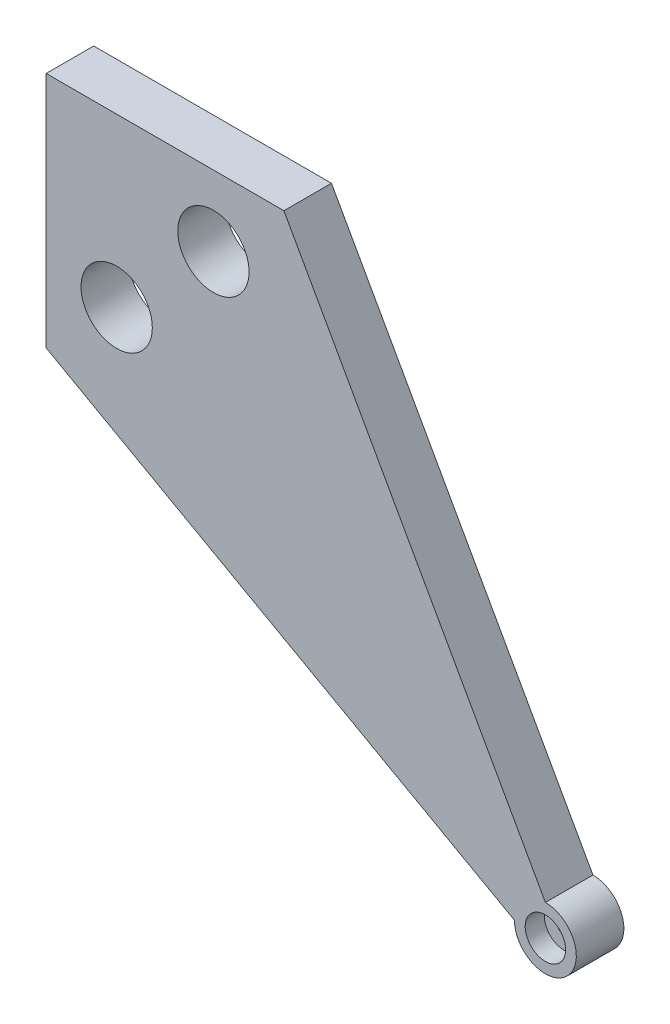
ISO-10303-21;
HEADER;
FILE_DESCRIPTION(('STEP AP214'),'2;1');
FILE_NAME('part.step','',(''),(''),'','','');
FILE_SCHEMA(('AUTOMOTIVE_DESIGN { 1 0 10303 214 1 1 1 1 }'));
ENDSEC;
DATA;
#1=APPLICATION_CONTEXT('core data for automotive mechanical design processes');
#2=APPLICATION_PROTOCOL_DEFINITION('international standard','automotive_design',2000,#1);
#3=PRODUCT_CONTEXT('',#1,'mechanical');
#4=PRODUCT('Part','Part','',(#3));
#5=PRODUCT_RELATED_PRODUCT_CATEGORY('part','',(#4));
#6=PRODUCT_DEFINITION_FORMATION('','',#4);
#7=PRODUCT_DEFINITION_CONTEXT('part definition',#1,'design');
#8=PRODUCT_DEFINITION('design','',#6,#7);
#9=PRODUCT_DEFINITION_SHAPE('','',#8);
#10=(LENGTH_UNIT() NAMED_UNIT(*) SI_UNIT(.MILLI.,.METRE.));
#11=(NAMED_UNIT(*) PLANE_ANGLE_UNIT() SI_UNIT($,.RADIAN.));
#12=(NAMED_UNIT(*) SI_UNIT($,.STERADIAN.) SOLID_ANGLE_UNIT());
#13=UNCERTAINTY_MEASURE_WITH_UNIT(LENGTH_MEASURE(1.E-05),#10,'distance_accuracy_value','');
#14=(GEOMETRIC_REPRESENTATION_CONTEXT(3) GLOBAL_UNCERTAINTY_ASSIGNED_CONTEXT((#13)) GLOBAL_UNIT_ASSIGNED_CONTEXT((#10,
#11,#12)) REPRESENTATION_CONTEXT('',''));
#15=CARTESIAN_POINT('',(0.,0.,0.));
#16=DIRECTION('',(0.,0.,1.));
#17=DIRECTION('',(1.,0.,0.));
#18=AXIS2_PLACEMENT_3D('',#15,#16,#17);
#19=CARTESIAN_POINT('',(0.,0.,5.));
#20=DIRECTION('',(1.,0.,0.));
#21=DIRECTION('',(0.,-1.,0.));
#22=AXIS2_PLACEMENT_3D('',#19,#20,#21);
#23=PLANE('',#22);
#24=DIRECTION('',(0.,1.,0.));
#25=VECTOR('',#24,1.);
#26=CARTESIAN_POINT('',(0.,0.,-5.));
#27=LINE('',#26,#25);
#28=CARTESIAN_POINT('',(0.,-50.,-5.));
#29=VERTEX_POINT('',#28);
#30=CARTESIAN_POINT('',(0.,0.,-5.));
#31=VERTEX_POINT('',#30);
#32=EDGE_CURVE('E119',#29,#31,#27,.T.);
#33=ORIENTED_EDGE('',*,*,#32,.F.);
#34=DIRECTION('',(0.,0.,-1.));
#35=VECTOR('',#34,1.);
#36=CARTESIAN_POINT('',(0.,-50.,5.));
#37=LINE('',#36,#35);
#38=CARTESIAN_POINT('',(0.,-50.,5.));
#39=VERTEX_POINT('',#38);
#40=EDGE_CURVE('E118',#39,#29,#37,.T.);
#41=ORIENTED_EDGE('',*,*,#40,.F.);
#42=DIRECTION('',(0.,1.,0.));
#43=VECTOR('',#42,1.);
#44=CARTESIAN_POINT('',(0.,0.,5.));
#45=LINE('',#44,#43);
#46=CARTESIAN_POINT('',(0.,0.,5.));
#47=VERTEX_POINT('',#46);
#48=EDGE_CURVE('E112',#39,#47,#45,.T.);
#49=ORIENTED_EDGE('',*,*,#48,.T.);
#50=DIRECTION('',(0.,0.,-1.));
#51=VECTOR('',#50,1.);
#52=CARTESIAN_POINT('',(0.,0.,5.));
#53=LINE('',#52,#51);
#54=EDGE_CURVE('E11',#47,#31,#53,.T.);
#55=ORIENTED_EDGE('',*,*,#54,.T.);
#56=EDGE_LOOP('',(#33,#41,#49,#55));
#57=FACE_BOUND('',#56,.T.);
#58=ADVANCED_FACE('F38',(#57),#23,.F.);
#59=CARTESIAN_POINT('',(0.,0.,5.));
#60=DIRECTION('',(0.,-1.,0.));
#61=DIRECTION('',(0.,0.,1.));
#62=AXIS2_PLACEMENT_3D('',#59,#60,#61);
#63=PLANE('',#62);
#64=DIRECTION('',(1.,0.,0.));
#65=VECTOR('',#64,1.);
#66=CARTESIAN_POINT('',(0.,0.,-5.));
#67=LINE('',#66,#65);
#68=CARTESIAN_POINT('',(50.,0.,-5.));
#69=VERTEX_POINT('',#68);
#70=EDGE_CURVE('E122',#31,#69,#67,.T.);
#71=ORIENTED_EDGE('',*,*,#70,.F.);
#72=ORIENTED_EDGE('',*,*,#54,.F.);
#73=DIRECTION('',(1.,0.,0.));
#74=VECTOR('',#73,1.);
#75=CARTESIAN_POINT('',(0.,0.,5.));
#76=LINE('',#75,#74);
#77=CARTESIAN_POINT('',(50.,0.,5.));
#78=VERTEX_POINT('',#77);
#79=EDGE_CURVE('E84',#47,#78,#76,.T.);
#80=ORIENTED_EDGE('',*,*,#79,.T.);
#81=DIRECTION('',(0.,0.,-1.));
#82=VECTOR('',#81,1.);
#83=CARTESIAN_POINT('',(50.,0.,5.));
#84=LINE('',#83,#82);
#85=EDGE_CURVE('E47',#78,#69,#84,.T.);
#86=ORIENTED_EDGE('',*,*,#85,.T.);
#87=EDGE_LOOP('',(#71,#72,#80,#86));
#88=FACE_BOUND('',#87,.T.);
#89=ADVANCED_FACE('F139',(#88),#63,.F.);
#90=CARTESIAN_POINT('',(50.,0.,5.));
#91=DIRECTION('',(-0.873109961084313,-0.487523328524236,0.));
#92=DIRECTION('',(-0.487523328524236,0.873109961084313,0.));
#93=AXIS2_PLACEMENT_3D('',#90,#91,#92);
#94=PLANE('',#93);
#95=DIRECTION('',(0.487523328524236,-0.873109961084313,0.));
#96=VECTOR('',#95,1.);
#97=CARTESIAN_POINT('',(50.,0.,-5.));
#98=LINE('',#97,#96);
#99=CARTESIAN_POINT('',(105.,-98.5,-5.));
#100=VERTEX_POINT('',#99);
#101=EDGE_CURVE('E127',#69,#100,#98,.T.);
#102=ORIENTED_EDGE('',*,*,#101,.F.);
#103=ORIENTED_EDGE('',*,*,#85,.F.);
#104=DIRECTION('',(0.487523328524236,-0.873109961084313,0.));
#105=VECTOR('',#104,1.);
#106=CARTESIAN_POINT('',(50.,0.,5.));
#107=LINE('',#106,#105);
#108=CARTESIAN_POINT('',(105.,-98.5,5.));
#109=VERTEX_POINT('',#108);
#110=EDGE_CURVE('E93',#78,#109,#107,.T.);
#111=ORIENTED_EDGE('',*,*,#110,.T.);
#112=DIRECTION('',(0.,0.,-1.));
#113=VECTOR('',#112,1.);
#114=CARTESIAN_POINT('',(105.,-98.5,5.));
#115=LINE('',#114,#113);
#116=EDGE_CURVE('E99',#109,#100,#115,.T.);
#117=ORIENTED_EDGE('',*,*,#116,.T.);
#118=EDGE_LOOP('',(#102,#103,#111,#117));
#119=FACE_BOUND('',#118,.T.);
#120=ADVANCED_FACE('F107',(#119),#94,.F.);
#121=CARTESIAN_POINT('',(105.,-105.,5.));
#122=DIRECTION('',(0.,0.,-1.));
#123=DIRECTION('',(-1.,0.,0.));
#124=AXIS2_PLACEMENT_3D('',#121,#122,#123);
#125=CYLINDRICAL_SURFACE('',#124,6.50000000000001);
#126=CARTESIAN_POINT('',(105.,-105.,-5.));
#127=DIRECTION('',(0.,0.,-1.));
#128=DIRECTION('',(1.,0.,0.));
#129=AXIS2_PLACEMENT_3D('',#126,#127,#128);
#130=CIRCLE('',#129,6.50000000000001);
#131=CARTESIAN_POINT('',(98.5,-105.,-5.));
#132=VERTEX_POINT('',#131);
#133=EDGE_CURVE('E101',#100,#132,#130,.T.);
#134=ORIENTED_EDGE('',*,*,#133,.F.);
#135=ORIENTED_EDGE('',*,*,#116,.F.);
#136=CARTESIAN_POINT('',(105.,-105.,5.));
#137=DIRECTION('',(0.,0.,-1.));
#138=DIRECTION('',(1.,0.,0.));
#139=AXIS2_PLACEMENT_3D('',#136,#137,#138);
#140=CIRCLE('',#139,6.50000000000001);
#141=CARTESIAN_POINT('',(98.5,-105.,5.));
#142=VERTEX_POINT('',#141);
#143=EDGE_CURVE('E89',#109,#142,#140,.T.);
#144=ORIENTED_EDGE('',*,*,#143,.T.);
#145=DIRECTION('',(0.,0.,-1.));
#146=VECTOR('',#145,1.);
#147=CARTESIAN_POINT('',(98.5,-105.,5.));
#148=LINE('',#147,#146);
#149=EDGE_CURVE('E105',#142,#132,#148,.T.);
#150=ORIENTED_EDGE('',*,*,#149,.T.);
#151=EDGE_LOOP('',(#134,#135,#144,#150));
#152=FACE_BOUND('',#151,.T.);
#153=ADVANCED_FACE('F100',(#152),#125,.T.);
#154=CARTESIAN_POINT('',(0.,-50.,5.));
#155=DIRECTION('',(0.487523328524236,0.873109961084313,0.));
#156=DIRECTION('',(0.873109961084313,-0.487523328524236,0.));
#157=AXIS2_PLACEMENT_3D('',#154,#155,#156);
#158=PLANE('',#157);
#159=DIRECTION('',(-0.873109961084313,0.487523328524236,0.));
#160=VECTOR('',#159,1.);
#161=CARTESIAN_POINT('',(0.,-50.,-5.));
#162=LINE('',#161,#160);
#163=EDGE_CURVE('E72',#132,#29,#162,.T.);
#164=ORIENTED_EDGE('',*,*,#163,.F.);
#165=ORIENTED_EDGE('',*,*,#149,.F.);
#166=DIRECTION('',(-0.873109961084313,0.487523328524236,0.));
#167=VECTOR('',#166,1.);
#168=CARTESIAN_POINT('',(0.,-50.,5.));
#169=LINE('',#168,#167);
#170=EDGE_CURVE('E55',#142,#39,#169,.T.);
#171=ORIENTED_EDGE('',*,*,#170,.T.);
#172=ORIENTED_EDGE('',*,*,#40,.T.);
#173=EDGE_LOOP('',(#164,#165,#171,#172));
#174=FACE_BOUND('',#173,.T.);
#175=ADVANCED_FACE('F209',(#174),#158,.F.);
#176=CARTESIAN_POINT('',(105.,-105.,5.));
#177=DIRECTION('',(0.,0.,1.));
#178=DIRECTION('',(1.,0.,0.));
#179=AXIS2_PLACEMENT_3D('',#176,#177,#178);
#180=PLANE('',#179);
#181=CARTESIAN_POINT('',(14.8255588340632,-35.1744411659368,5.));
#182=DIRECTION('',(0.,0.,-1.));
#183=DIRECTION('',(1.,0.,0.));
#184=AXIS2_PLACEMENT_3D('',#181,#182,#183);
#185=CIRCLE('',#184,7.5);
#186=CARTESIAN_POINT('',(22.3255588340632,-35.1744411659368,5.));
#187=VERTEX_POINT('',#186);
#188=EDGE_CURVE('E171',#187,#187,#185,.T.);
#189=ORIENTED_EDGE('',*,*,#188,.T.);
#190=EDGE_LOOP('',(#189));
#191=FACE_BOUND('',#190,.T.);
#192=CARTESIAN_POINT('',(35.1744411659368,-14.8255588340632,5.));
#193=DIRECTION('',(0.,0.,-1.));
#194=DIRECTION('',(1.,0.,0.));
#195=AXIS2_PLACEMENT_3D('',#192,#193,#194);
#196=CIRCLE('',#195,7.5);
#197=CARTESIAN_POINT('',(42.6744411659368,-14.8255588340632,5.));
#198=VERTEX_POINT('',#197);
#199=EDGE_CURVE('E163',#198,#198,#196,.T.);
#200=ORIENTED_EDGE('',*,*,#199,.T.);
#201=EDGE_LOOP('',(#200));
#202=FACE_BOUND('',#201,.T.);
#203=CARTESIAN_POINT('',(105.,-105.,5.));
#204=DIRECTION('',(0.,0.,-1.));
#205=DIRECTION('',(1.,0.,0.));
#206=AXIS2_PLACEMENT_3D('',#203,#204,#205);
#207=CIRCLE('',#206,4.25000000000001);
#208=CARTESIAN_POINT('',(109.25,-105.,5.));
#209=VERTEX_POINT('',#208);
#210=EDGE_CURVE('E147',#209,#209,#207,.T.);
#211=ORIENTED_EDGE('',*,*,#210,.T.);
#212=EDGE_LOOP('',(#211));
#213=FACE_BOUND('',#212,.T.);
#214=ORIENTED_EDGE('',*,*,#48,.F.);
#215=ORIENTED_EDGE('',*,*,#170,.F.);
#216=ORIENTED_EDGE('',*,*,#143,.F.);
#217=ORIENTED_EDGE('',*,*,#110,.F.);
#218=ORIENTED_EDGE('',*,*,#79,.F.);
#219=EDGE_LOOP('',(#214,#215,#216,#217,#218));
#220=FACE_BOUND('',#219,.T.);
#221=ADVANCED_FACE('F91',(#191,#202,#213,#220),#180,.T.);
#222=CARTESIAN_POINT('',(105.,-105.,-5.));
#223=DIRECTION('',(0.,0.,1.));
#224=DIRECTION('',(1.,0.,0.));
#225=AXIS2_PLACEMENT_3D('',#222,#223,#224);
#226=PLANE('',#225);
#227=CARTESIAN_POINT('',(14.8255588340632,-35.1744411659368,-5.));
#228=DIRECTION('',(0.,0.,-1.));
#229=DIRECTION('',(1.,0.,0.));
#230=AXIS2_PLACEMENT_3D('',#227,#228,#229);
#231=CIRCLE('',#230,7.5);
#232=CARTESIAN_POINT('',(22.3255588340632,-35.1744411659368,-5.));
#233=VERTEX_POINT('',#232);
#234=EDGE_CURVE('E159',#233,#233,#231,.T.);
#235=ORIENTED_EDGE('',*,*,#234,.F.);
#236=EDGE_LOOP('',(#235));
#237=FACE_BOUND('',#236,.T.);
#238=CARTESIAN_POINT('',(35.1744411659368,-14.8255588340632,-5.));
#239=DIRECTION('',(0.,0.,-1.));
#240=DIRECTION('',(1.,0.,0.));
#241=AXIS2_PLACEMENT_3D('',#238,#239,#240);
#242=CIRCLE('',#241,7.5);
#243=CARTESIAN_POINT('',(42.6744411659368,-14.8255588340632,-5.));
#244=VERTEX_POINT('',#243);
#245=EDGE_CURVE('E167',#244,#244,#242,.T.);
#246=ORIENTED_EDGE('',*,*,#245,.F.);
#247=EDGE_LOOP('',(#246));
#248=FACE_BOUND('',#247,.T.);
#249=CARTESIAN_POINT('',(105.,-105.,-5.));
#250=DIRECTION('',(0.,0.,-1.));
#251=DIRECTION('',(1.,0.,0.));
#252=AXIS2_PLACEMENT_3D('',#249,#250,#251);
#253=CIRCLE('',#252,1.5);
#254=CARTESIAN_POINT('',(106.5,-105.,-5.));
#255=VERTEX_POINT('',#254);
#256=EDGE_CURVE('E151',#255,#255,#253,.T.);
#257=ORIENTED_EDGE('',*,*,#256,.F.);
#258=EDGE_LOOP('',(#257));
#259=FACE_BOUND('',#258,.T.);
#260=ORIENTED_EDGE('',*,*,#32,.T.);
#261=ORIENTED_EDGE('',*,*,#70,.T.);
#262=ORIENTED_EDGE('',*,*,#101,.T.);
#263=ORIENTED_EDGE('',*,*,#133,.T.);
#264=ORIENTED_EDGE('',*,*,#163,.T.);
#265=EDGE_LOOP('',(#260,#261,#262,#263,#264));
#266=FACE_BOUND('',#265,.T.);
#267=ADVANCED_FACE('F140',(#237,#248,#259,#266),#226,.F.);
#268=CARTESIAN_POINT('',(105.,-105.,1.));
#269=DIRECTION('',(0.,0.,1.));
#270=DIRECTION('',(1.,0.,0.));
#271=AXIS2_PLACEMENT_3D('',#268,#269,#270);
#272=CYLINDRICAL_SURFACE('',#271,4.25000000000001);
#273=CARTESIAN_POINT('',(105.,-105.,1.));
#274=DIRECTION('',(0.,0.,-1.));
#275=DIRECTION('',(1.,0.,0.));
#276=AXIS2_PLACEMENT_3D('',#273,#274,#275);
#277=CIRCLE('',#276,4.25000000000001);
#278=CARTESIAN_POINT('',(109.25,-105.,1.));
#279=VERTEX_POINT('',#278);
#280=EDGE_CURVE('E123',#279,#279,#277,.T.);
#281=ORIENTED_EDGE('',*,*,#280,.T.);
#282=EDGE_LOOP('',(#281));
#283=FACE_BOUND('',#282,.T.);
#284=ORIENTED_EDGE('',*,*,#210,.F.);
#285=EDGE_LOOP('',(#284));
#286=FACE_BOUND('',#285,.T.);
#287=ADVANCED_FACE('F184',(#283,#286),#272,.F.);
#288=CARTESIAN_POINT('',(105.,-105.,1.));
#289=DIRECTION('',(0.,0.,1.));
#290=DIRECTION('',(1.,0.,0.));
#291=AXIS2_PLACEMENT_3D('',#288,#289,#290);
#292=PLANE('',#291);
#293=CARTESIAN_POINT('',(105.,-105.,1.));
#294=DIRECTION('',(0.,0.,-1.));
#295=DIRECTION('',(1.,0.,0.));
#296=AXIS2_PLACEMENT_3D('',#293,#294,#295);
#297=CIRCLE('',#296,1.5);
#298=CARTESIAN_POINT('',(106.5,-105.,1.));
#299=VERTEX_POINT('',#298);
#300=EDGE_CURVE('E155',#299,#299,#297,.T.);
#301=ORIENTED_EDGE('',*,*,#300,.T.);
#302=EDGE_LOOP('',(#301));
#303=FACE_BOUND('',#302,.T.);
#304=ORIENTED_EDGE('',*,*,#280,.F.);
#305=EDGE_LOOP('',(#304));
#306=FACE_BOUND('',#305,.T.);
#307=ADVANCED_FACE('F194',(#303,#306),#292,.T.);
#308=CARTESIAN_POINT('',(105.,-105.,-5.));
#309=DIRECTION('',(0.,0.,1.));
#310=DIRECTION('',(1.,0.,0.));
#311=AXIS2_PLACEMENT_3D('',#308,#309,#310);
#312=CYLINDRICAL_SURFACE('',#311,1.5);
#313=ORIENTED_EDGE('',*,*,#256,.T.);
#314=EDGE_LOOP('',(#313));
#315=FACE_BOUND('',#314,.T.);
#316=ORIENTED_EDGE('',*,*,#300,.F.);
#317=EDGE_LOOP('',(#316));
#318=FACE_BOUND('',#317,.T.);
#319=ADVANCED_FACE('F190',(#315,#318),#312,.F.);
#320=CARTESIAN_POINT('',(35.1744411659368,-14.8255588340632,-5.));
#321=DIRECTION('',(0.,0.,1.));
#322=DIRECTION('',(1.,0.,0.));
#323=AXIS2_PLACEMENT_3D('',#320,#321,#322);
#324=CYLINDRICAL_SURFACE('',#323,7.5);
#325=ORIENTED_EDGE('',*,*,#245,.T.);
#326=EDGE_LOOP('',(#325));
#327=FACE_BOUND('',#326,.T.);
#328=ORIENTED_EDGE('',*,*,#199,.F.);
#329=EDGE_LOOP('',(#328));
#330=FACE_BOUND('',#329,.T.);
#331=ADVANCED_FACE('F193',(#327,#330),#324,.F.);
#332=CARTESIAN_POINT('',(14.8255588340632,-35.1744411659368,-5.));
#333=DIRECTION('',(0.,0.,1.));
#334=DIRECTION('',(1.,0.,0.));
#335=AXIS2_PLACEMENT_3D('',#332,#333,#334);
#336=CYLINDRICAL_SURFACE('',#335,7.5);
#337=ORIENTED_EDGE('',*,*,#234,.T.);
#338=EDGE_LOOP('',(#337));
#339=FACE_BOUND('',#338,.T.);
#340=ORIENTED_EDGE('',*,*,#188,.F.);
#341=EDGE_LOOP('',(#340));
#342=FACE_BOUND('',#341,.T.);
#343=ADVANCED_FACE('F179',(#339,#342),#336,.F.);
#344=CLOSED_SHELL('',(#58,#89,#120,#153,#175,#221,#267,#287,#307,#319,#331,#343));
#345=MANIFOLD_SOLID_BREP('B2',#344);
#346=ADVANCED_BREP_SHAPE_REPRESENTATION('',(#18,#345),#14);
#347=SHAPE_DEFINITION_REPRESENTATION(#9,#346);
ENDSEC;
END-ISO-10303-21;
